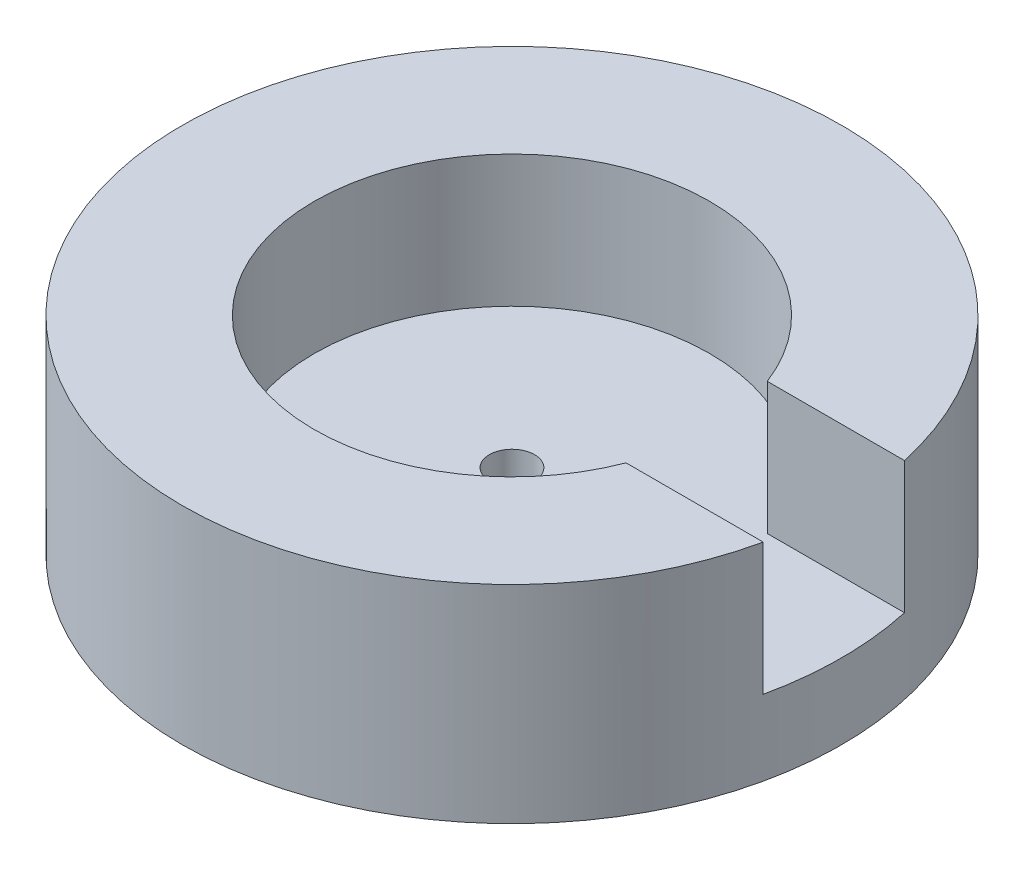
ISO-10303-21;
HEADER;
FILE_DESCRIPTION(('STEP AP214'),'2;1');
FILE_NAME('part.step','',(''),(''),'','','');
FILE_SCHEMA(('AUTOMOTIVE_DESIGN { 1 0 10303 214 1 1 1 1 }'));
ENDSEC;
DATA;
#1=APPLICATION_CONTEXT('core data for automotive mechanical design processes');
#2=APPLICATION_PROTOCOL_DEFINITION('international standard','automotive_design',2000,#1);
#3=PRODUCT_CONTEXT('',#1,'mechanical');
#4=PRODUCT('Part','Part','',(#3));
#5=PRODUCT_RELATED_PRODUCT_CATEGORY('part','',(#4));
#6=PRODUCT_DEFINITION_FORMATION('','',#4);
#7=PRODUCT_DEFINITION_CONTEXT('part definition',#1,'design');
#8=PRODUCT_DEFINITION('design','',#6,#7);
#9=PRODUCT_DEFINITION_SHAPE('','',#8);
#10=(LENGTH_UNIT() NAMED_UNIT(*) SI_UNIT(.MILLI.,.METRE.));
#11=(NAMED_UNIT(*) PLANE_ANGLE_UNIT() SI_UNIT($,.RADIAN.));
#12=(NAMED_UNIT(*) SI_UNIT($,.STERADIAN.) SOLID_ANGLE_UNIT());
#13=UNCERTAINTY_MEASURE_WITH_UNIT(LENGTH_MEASURE(1.E-05),#10,'distance_accuracy_value','');
#14=(GEOMETRIC_REPRESENTATION_CONTEXT(3) GLOBAL_UNCERTAINTY_ASSIGNED_CONTEXT((#13)) GLOBAL_UNIT_ASSIGNED_CONTEXT((#10,
#11,#12)) REPRESENTATION_CONTEXT('',''));
#15=CARTESIAN_POINT('',(0.,0.,0.));
#16=DIRECTION('',(0.,0.,1.));
#17=DIRECTION('',(1.,0.,0.));
#18=AXIS2_PLACEMENT_3D('',#15,#16,#17);
#19=CARTESIAN_POINT('',(0.,-4.,0.));
#20=DIRECTION('',(0.,1.,0.));
#21=DIRECTION('',(0.,0.,1.));
#22=AXIS2_PLACEMENT_3D('',#19,#20,#21);
#23=CYLINDRICAL_SURFACE('',#22,17.5);
#24=CARTESIAN_POINT('',(0.,-4.,0.));
#25=DIRECTION('',(0.,1.,0.));
#26=DIRECTION('',(0.,0.,1.));
#27=AXIS2_PLACEMENT_3D('',#24,#25,#26);
#28=CIRCLE('',#27,17.5);
#29=CARTESIAN_POINT('',(0.,-4.,17.5));
#30=VERTEX_POINT('',#29);
#31=EDGE_CURVE('E11',#30,#30,#28,.T.);
#32=ORIENTED_EDGE('',*,*,#31,.T.);
#33=EDGE_LOOP('',(#32));
#34=FACE_BOUND('',#33,.T.);
#35=CARTESIAN_POINT('',(0.,0.,0.));
#36=DIRECTION('',(0.,1.,0.));
#37=DIRECTION('',(0.,0.,1.));
#38=AXIS2_PLACEMENT_3D('',#35,#36,#37);
#39=CIRCLE('',#38,17.5);
#40=CARTESIAN_POINT('',(17.0934929139717,0.,3.75));
#41=VERTEX_POINT('',#40);
#42=CARTESIAN_POINT('',(17.0934929139717,0.,-3.75));
#43=VERTEX_POINT('',#42);
#44=EDGE_CURVE('E38',#41,#43,#39,.T.);
#45=ORIENTED_EDGE('',*,*,#44,.F.);
#46=DIRECTION('',(0.,-1.,0.));
#47=VECTOR('',#46,1.);
#48=CARTESIAN_POINT('',(17.0934929139717,7.,3.75));
#49=LINE('',#48,#47);
#50=CARTESIAN_POINT('',(17.0934929139717,7.,3.75));
#51=VERTEX_POINT('',#50);
#52=EDGE_CURVE('E49',#51,#41,#49,.T.);
#53=ORIENTED_EDGE('',*,*,#52,.F.);
#54=CARTESIAN_POINT('',(0.,7.,0.));
#55=DIRECTION('',(0.,1.,0.));
#56=DIRECTION('',(0.,0.,1.));
#57=AXIS2_PLACEMENT_3D('',#54,#55,#56);
#58=CIRCLE('',#57,17.5);
#59=CARTESIAN_POINT('',(17.0934929139717,7.,-3.75));
#60=VERTEX_POINT('',#59);
#61=EDGE_CURVE('E78',#60,#51,#58,.T.);
#62=ORIENTED_EDGE('',*,*,#61,.F.);
#63=DIRECTION('',(0.,-1.,0.));
#64=VECTOR('',#63,1.);
#65=CARTESIAN_POINT('',(17.0934929139717,7.,-3.75));
#66=LINE('',#65,#64);
#67=EDGE_CURVE('E90',#60,#43,#66,.T.);
#68=ORIENTED_EDGE('',*,*,#67,.T.);
#69=EDGE_LOOP('',(#45,#53,#62,#68));
#70=FACE_BOUND('',#69,.T.);
#71=ADVANCED_FACE('F35',(#34,#70),#23,.T.);
#72=CARTESIAN_POINT('',(0.,-4.,0.));
#73=DIRECTION('',(0.,1.,0.));
#74=DIRECTION('',(0.,0.,1.));
#75=AXIS2_PLACEMENT_3D('',#72,#73,#74);
#76=PLANE('',#75);
#77=ORIENTED_EDGE('',*,*,#31,.F.);
#78=EDGE_LOOP('',(#77));
#79=FACE_BOUND('',#78,.T.);
#80=ADVANCED_FACE('F124',(#79),#76,.F.);
#81=CARTESIAN_POINT('',(0.,0.,0.));
#82=DIRECTION('',(0.,1.,0.));
#83=DIRECTION('',(0.,0.,1.));
#84=AXIS2_PLACEMENT_3D('',#81,#82,#83);
#85=PLANE('',#84);
#86=CARTESIAN_POINT('',(0.,0.,0.));
#87=DIRECTION('',(0.,1.,0.));
#88=DIRECTION('',(0.,0.,1.));
#89=AXIS2_PLACEMENT_3D('',#86,#87,#88);
#90=CIRCLE('',#89,1.2);
#91=CARTESIAN_POINT('',(0.,0.,1.2));
#92=VERTEX_POINT('',#91);
#93=EDGE_CURVE('E141',#92,#92,#90,.T.);
#94=ORIENTED_EDGE('',*,*,#93,.F.);
#95=EDGE_LOOP('',(#94));
#96=FACE_BOUND('',#95,.T.);
#97=DIRECTION('',(1.,0.,0.));
#98=VECTOR('',#97,1.);
#99=CARTESIAN_POINT('',(0.,0.,-3.75));
#100=LINE('',#99,#98);
#101=CARTESIAN_POINT('',(9.80752262296652,0.,-3.75));
#102=VERTEX_POINT('',#101);
#103=EDGE_CURVE('E99',#102,#43,#100,.T.);
#104=ORIENTED_EDGE('',*,*,#103,.F.);
#105=CARTESIAN_POINT('',(0.,0.,0.));
#106=DIRECTION('',(0.,1.,0.));
#107=DIRECTION('',(0.,0.,1.));
#108=AXIS2_PLACEMENT_3D('',#105,#106,#107);
#109=CIRCLE('',#108,10.5);
#110=CARTESIAN_POINT('',(9.80752262296652,0.,3.75));
#111=VERTEX_POINT('',#110);
#112=EDGE_CURVE('E104',#102,#111,#109,.T.);
#113=ORIENTED_EDGE('',*,*,#112,.T.);
#114=DIRECTION('',(1.,0.,0.));
#115=VECTOR('',#114,1.);
#116=CARTESIAN_POINT('',(0.,0.,3.75));
#117=LINE('',#116,#115);
#118=EDGE_CURVE('E101',#111,#41,#117,.T.);
#119=ORIENTED_EDGE('',*,*,#118,.T.);
#120=ORIENTED_EDGE('',*,*,#44,.T.);
#121=EDGE_LOOP('',(#104,#113,#119,#120));
#122=FACE_BOUND('',#121,.T.);
#123=ADVANCED_FACE('F111',(#96,#122),#85,.T.);
#124=CARTESIAN_POINT('',(0.,7.,-3.75));
#125=DIRECTION('',(0.,0.,-1.));
#126=DIRECTION('',(-1.,0.,0.));
#127=AXIS2_PLACEMENT_3D('',#124,#125,#126);
#128=PLANE('',#127);
#129=ORIENTED_EDGE('',*,*,#103,.T.);
#130=ORIENTED_EDGE('',*,*,#67,.F.);
#131=DIRECTION('',(1.,0.,0.));
#132=VECTOR('',#131,1.);
#133=CARTESIAN_POINT('',(0.,7.,-3.75));
#134=LINE('',#133,#132);
#135=CARTESIAN_POINT('',(9.80752262296652,7.,-3.75));
#136=VERTEX_POINT('',#135);
#137=EDGE_CURVE('E85',#136,#60,#134,.T.);
#138=ORIENTED_EDGE('',*,*,#137,.F.);
#139=DIRECTION('',(0.,-1.,0.));
#140=VECTOR('',#139,1.);
#141=CARTESIAN_POINT('',(9.80752262296652,7.,-3.75));
#142=LINE('',#141,#140);
#143=EDGE_CURVE('E58',#136,#102,#142,.T.);
#144=ORIENTED_EDGE('',*,*,#143,.T.);
#145=EDGE_LOOP('',(#129,#130,#138,#144));
#146=FACE_BOUND('',#145,.T.);
#147=ADVANCED_FACE('F121',(#146),#128,.F.);
#148=CARTESIAN_POINT('',(0.,7.,3.75));
#149=DIRECTION('',(0.,0.,-1.));
#150=DIRECTION('',(-1.,0.,0.));
#151=AXIS2_PLACEMENT_3D('',#148,#149,#150);
#152=PLANE('',#151);
#153=ORIENTED_EDGE('',*,*,#118,.F.);
#154=DIRECTION('',(0.,-1.,0.));
#155=VECTOR('',#154,1.);
#156=CARTESIAN_POINT('',(9.80752262296652,7.,3.75));
#157=LINE('',#156,#155);
#158=CARTESIAN_POINT('',(9.80752262296652,7.,3.75));
#159=VERTEX_POINT('',#158);
#160=EDGE_CURVE('E91',#159,#111,#157,.T.);
#161=ORIENTED_EDGE('',*,*,#160,.F.);
#162=DIRECTION('',(1.,0.,0.));
#163=VECTOR('',#162,1.);
#164=CARTESIAN_POINT('',(0.,7.,3.75));
#165=LINE('',#164,#163);
#166=EDGE_CURVE('E84',#159,#51,#165,.T.);
#167=ORIENTED_EDGE('',*,*,#166,.T.);
#168=ORIENTED_EDGE('',*,*,#52,.T.);
#169=EDGE_LOOP('',(#153,#161,#167,#168));
#170=FACE_BOUND('',#169,.T.);
#171=ADVANCED_FACE('F93',(#170),#152,.T.);
#172=CARTESIAN_POINT('',(0.,7.,0.));
#173=DIRECTION('',(0.,-1.,0.));
#174=DIRECTION('',(0.,0.,-1.));
#175=AXIS2_PLACEMENT_3D('',#172,#173,#174);
#176=CYLINDRICAL_SURFACE('',#175,10.5);
#177=ORIENTED_EDGE('',*,*,#112,.F.);
#178=ORIENTED_EDGE('',*,*,#143,.F.);
#179=CARTESIAN_POINT('',(0.,7.,0.));
#180=DIRECTION('',(0.,1.,0.));
#181=DIRECTION('',(0.,0.,1.));
#182=AXIS2_PLACEMENT_3D('',#179,#180,#181);
#183=CIRCLE('',#182,10.5);
#184=EDGE_CURVE('E94',#136,#159,#183,.T.);
#185=ORIENTED_EDGE('',*,*,#184,.T.);
#186=ORIENTED_EDGE('',*,*,#160,.T.);
#187=EDGE_LOOP('',(#177,#178,#185,#186));
#188=FACE_BOUND('',#187,.T.);
#189=ADVANCED_FACE('F112',(#188),#176,.F.);
#190=CARTESIAN_POINT('',(0.,7.,0.));
#191=DIRECTION('',(0.,1.,0.));
#192=DIRECTION('',(0.,0.,1.));
#193=AXIS2_PLACEMENT_3D('',#190,#191,#192);
#194=PLANE('',#193);
#195=ORIENTED_EDGE('',*,*,#137,.T.);
#196=ORIENTED_EDGE('',*,*,#61,.T.);
#197=ORIENTED_EDGE('',*,*,#166,.F.);
#198=ORIENTED_EDGE('',*,*,#184,.F.);
#199=EDGE_LOOP('',(#195,#196,#197,#198));
#200=FACE_BOUND('',#199,.T.);
#201=ADVANCED_FACE('F82',(#200),#194,.T.);
#202=CARTESIAN_POINT('',(0.,-1.5,0.));
#203=DIRECTION('',(0.,1.,0.));
#204=DIRECTION('',(0.,0.,1.));
#205=AXIS2_PLACEMENT_3D('',#202,#203,#204);
#206=CYLINDRICAL_SURFACE('',#205,1.2);
#207=CARTESIAN_POINT('',(0.,-1.5,0.));
#208=DIRECTION('',(0.,1.,0.));
#209=DIRECTION('',(0.,0.,1.));
#210=AXIS2_PLACEMENT_3D('',#207,#208,#209);
#211=CIRCLE('',#210,1.2);
#212=CARTESIAN_POINT('',(0.,-1.5,1.2));
#213=VERTEX_POINT('',#212);
#214=EDGE_CURVE('E102',#213,#213,#211,.T.);
#215=ORIENTED_EDGE('',*,*,#214,.F.);
#216=EDGE_LOOP('',(#215));
#217=FACE_BOUND('',#216,.T.);
#218=ORIENTED_EDGE('',*,*,#93,.T.);
#219=EDGE_LOOP('',(#218));
#220=FACE_BOUND('',#219,.T.);
#221=ADVANCED_FACE('F119',(#217,#220),#206,.F.);
#222=CARTESIAN_POINT('',(0.,-1.5,0.));
#223=DIRECTION('',(0.,1.,0.));
#224=DIRECTION('',(0.,0.,1.));
#225=AXIS2_PLACEMENT_3D('',#222,#223,#224);
#226=PLANE('',#225);
#227=ORIENTED_EDGE('',*,*,#214,.T.);
#228=EDGE_LOOP('',(#227));
#229=FACE_BOUND('',#228,.T.);
#230=ADVANCED_FACE('F147',(#229),#226,.T.);
#231=CLOSED_SHELL('',(#71,#80,#123,#147,#171,#189,#201,#221,#230));
#232=MANIFOLD_SOLID_BREP('B2',#231);
#233=ADVANCED_BREP_SHAPE_REPRESENTATION('',(#18,#232),#14);
#234=SHAPE_DEFINITION_REPRESENTATION(#9,#233);
ENDSEC;
END-ISO-10303-21;
